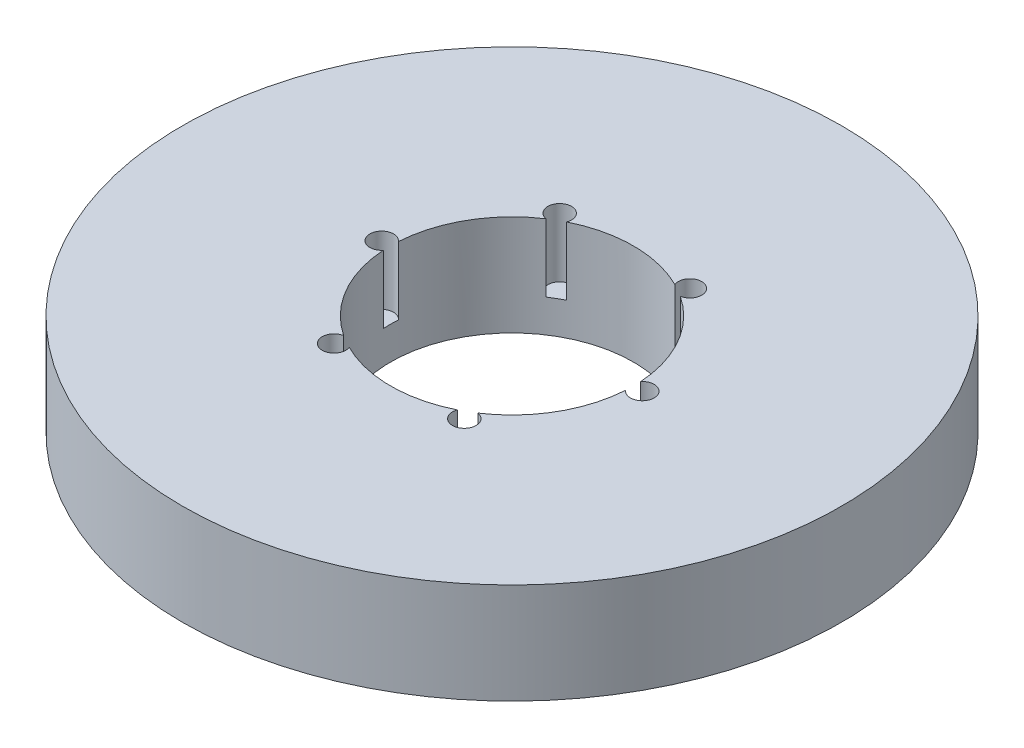
ISO-10303-21;
HEADER;
FILE_DESCRIPTION(('STEP AP214'),'2;1');
FILE_NAME('part.step','',(''),(''),'','','');
FILE_SCHEMA(('AUTOMOTIVE_DESIGN { 1 0 10303 214 1 1 1 1 }'));
ENDSEC;
DATA;
#1=APPLICATION_CONTEXT('core data for automotive mechanical design processes');
#2=APPLICATION_PROTOCOL_DEFINITION('international standard','automotive_design',2000,#1);
#3=PRODUCT_CONTEXT('',#1,'mechanical');
#4=PRODUCT('Part','Part','',(#3));
#5=PRODUCT_RELATED_PRODUCT_CATEGORY('part','',(#4));
#6=PRODUCT_DEFINITION_FORMATION('','',#4);
#7=PRODUCT_DEFINITION_CONTEXT('part definition',#1,'design');
#8=PRODUCT_DEFINITION('design','',#6,#7);
#9=PRODUCT_DEFINITION_SHAPE('','',#8);
#10=(LENGTH_UNIT() NAMED_UNIT(*) SI_UNIT(.MILLI.,.METRE.));
#11=(NAMED_UNIT(*) PLANE_ANGLE_UNIT() SI_UNIT($,.RADIAN.));
#12=(NAMED_UNIT(*) SI_UNIT($,.STERADIAN.) SOLID_ANGLE_UNIT());
#13=UNCERTAINTY_MEASURE_WITH_UNIT(LENGTH_MEASURE(1.E-05),#10,'distance_accuracy_value','');
#14=(GEOMETRIC_REPRESENTATION_CONTEXT(3) GLOBAL_UNCERTAINTY_ASSIGNED_CONTEXT((#13)) GLOBAL_UNIT_ASSIGNED_CONTEXT((#10,
#11,#12)) REPRESENTATION_CONTEXT('',''));
#15=CARTESIAN_POINT('',(0.,0.,0.));
#16=DIRECTION('',(0.,0.,1.));
#17=DIRECTION('',(1.,0.,0.));
#18=AXIS2_PLACEMENT_3D('',#15,#16,#17);
#19=CARTESIAN_POINT('',(0.,29.,0.));
#20=DIRECTION('',(0.,-1.,0.));
#21=DIRECTION('',(0.,0.,-1.));
#22=AXIS2_PLACEMENT_3D('',#19,#20,#21);
#23=CYLINDRICAL_SURFACE('',#22,95.);
#24=CARTESIAN_POINT('',(0.,29.,0.));
#25=DIRECTION('',(0.,1.,0.));
#26=DIRECTION('',(0.,0.,1.));
#27=AXIS2_PLACEMENT_3D('',#24,#25,#26);
#28=CIRCLE('',#27,95.);
#29=CARTESIAN_POINT('',(0.,29.,-95.));
#30=VERTEX_POINT('',#29);
#31=EDGE_CURVE('E171',#30,#30,#28,.T.);
#32=CARTESIAN_POINT('',(0.,0.,0.));
#33=DIRECTION('',(0.,1.,0.));
#34=DIRECTION('',(0.,0.,1.));
#35=AXIS2_PLACEMENT_3D('',#32,#33,#34);
#36=CIRCLE('',#35,95.);
#37=CARTESIAN_POINT('',(0.,0.,-95.));
#38=VERTEX_POINT('',#37);
#39=EDGE_CURVE('E157',#38,#38,#36,.T.);
#40=CARTESIAN_POINT('',(0.,29.,-95.));
#41=CARTESIAN_POINT('',(0.,28.6979166666667,-95.));
#42=CARTESIAN_POINT('',(0.,28.3958333333333,-95.));
#43=CARTESIAN_POINT('',(0.,27.7916666666667,-95.));
#44=CARTESIAN_POINT('',(0.,27.4895833333333,-95.));
#45=CARTESIAN_POINT('',(0.,26.8854166666667,-95.));
#46=CARTESIAN_POINT('',(0.,26.5833333333333,-95.));
#47=CARTESIAN_POINT('',(0.,25.9791666666667,-95.));
#48=CARTESIAN_POINT('',(0.,25.6770833333333,-95.));
#49=CARTESIAN_POINT('',(0.,25.0729166666667,-95.));
#50=CARTESIAN_POINT('',(0.,24.7708333333333,-95.));
#51=CARTESIAN_POINT('',(0.,24.1666666666667,-95.));
#52=CARTESIAN_POINT('',(0.,23.8645833333333,-95.));
#53=CARTESIAN_POINT('',(0.,23.2604166666667,-95.));
#54=CARTESIAN_POINT('',(0.,22.9583333333333,-95.));
#55=CARTESIAN_POINT('',(0.,22.3541666666667,-95.));
#56=CARTESIAN_POINT('',(0.,22.0520833333333,-95.));
#57=CARTESIAN_POINT('',(0.,21.4479166666667,-95.));
#58=CARTESIAN_POINT('',(0.,21.1458333333333,-95.));
#59=CARTESIAN_POINT('',(0.,20.5416666666667,-95.));
#60=CARTESIAN_POINT('',(0.,20.2395833333333,-95.));
#61=CARTESIAN_POINT('',(0.,19.6354166666667,-95.));
#62=CARTESIAN_POINT('',(0.,19.3333333333333,-95.));
#63=CARTESIAN_POINT('',(0.,18.7291666666667,-95.));
#64=CARTESIAN_POINT('',(0.,18.4270833333333,-95.));
#65=CARTESIAN_POINT('',(0.,17.8229166666667,-95.));
#66=CARTESIAN_POINT('',(0.,17.5208333333333,-95.));
#67=CARTESIAN_POINT('',(0.,16.9166666666667,-95.));
#68=CARTESIAN_POINT('',(0.,16.6145833333333,-95.));
#69=CARTESIAN_POINT('',(0.,16.0104166666667,-95.));
#70=CARTESIAN_POINT('',(0.,15.7083333333333,-95.));
#71=CARTESIAN_POINT('',(0.,15.1041666666667,-95.));
#72=CARTESIAN_POINT('',(0.,14.8020833333333,-95.));
#73=CARTESIAN_POINT('',(0.,14.1979166666667,-95.));
#74=CARTESIAN_POINT('',(0.,13.8958333333333,-95.));
#75=CARTESIAN_POINT('',(0.,13.2916666666667,-95.));
#76=CARTESIAN_POINT('',(0.,12.9895833333333,-95.));
#77=CARTESIAN_POINT('',(0.,12.3854166666667,-95.));
#78=CARTESIAN_POINT('',(0.,12.0833333333333,-95.));
#79=CARTESIAN_POINT('',(0.,11.4791666666667,-95.));
#80=CARTESIAN_POINT('',(0.,11.1770833333333,-95.));
#81=CARTESIAN_POINT('',(0.,10.5729166666667,-95.));
#82=CARTESIAN_POINT('',(0.,10.2708333333333,-95.));
#83=CARTESIAN_POINT('',(0.,9.66666666666667,-95.));
#84=CARTESIAN_POINT('',(0.,9.36458333333333,-95.));
#85=CARTESIAN_POINT('',(0.,8.76041666666667,-95.));
#86=CARTESIAN_POINT('',(0.,8.45833333333333,-95.));
#87=CARTESIAN_POINT('',(0.,7.85416666666667,-95.));
#88=CARTESIAN_POINT('',(0.,7.55208333333333,-95.));
#89=CARTESIAN_POINT('',(0.,6.94791666666667,-95.));
#90=CARTESIAN_POINT('',(0.,6.64583333333333,-95.));
#91=CARTESIAN_POINT('',(0.,6.04166666666667,-95.));
#92=CARTESIAN_POINT('',(0.,5.73958333333333,-95.));
#93=CARTESIAN_POINT('',(0.,5.13541666666667,-95.));
#94=CARTESIAN_POINT('',(0.,4.83333333333333,-95.));
#95=CARTESIAN_POINT('',(0.,4.22916666666667,-95.));
#96=CARTESIAN_POINT('',(0.,3.92708333333333,-95.));
#97=CARTESIAN_POINT('',(0.,3.32291666666667,-95.));
#98=CARTESIAN_POINT('',(0.,3.02083333333333,-95.));
#99=CARTESIAN_POINT('',(0.,2.41666666666667,-95.));
#100=CARTESIAN_POINT('',(0.,2.11458333333333,-95.));
#101=CARTESIAN_POINT('',(0.,1.51041666666667,-95.));
#102=CARTESIAN_POINT('',(0.,1.20833333333333,-95.));
#103=CARTESIAN_POINT('',(0.,0.604166666666667,-95.));
#104=CARTESIAN_POINT('',(0.,0.302083333333333,-95.));
#105=CARTESIAN_POINT('',(0.,0.,-95.));
#106=B_SPLINE_CURVE_WITH_KNOTS('',3,(#40,#41,#42,#43,#44,#45,#46,#47,#48,#49,#50,#51,#52,#53,
#54,#55,#56,#57,#58,#59,#60,#61,#62,#63,#64,#65,#66,#67,#68,#69,#70,#71,#72,#73,#74,#75,#76,#77,
#78,#79,#80,#81,#82,#83,#84,#85,#86,#87,#88,#89,#90,#91,#92,#93,#94,#95,#96,#97,#98,#99,#100,
#101,#102,#103,#104,#105),.UNSPECIFIED.,.F.,.F.,(4,2,2,2,2,2,2,2,2,2,2,2,2,2,2,2,2,2,2,2,2,2,2,
2,2,2,2,2,2,2,2,2,4),(0.,0.906249999999997,1.8125,2.71875,3.625,4.53125,5.4375,6.34375,7.25,
8.15625,9.0625,9.96875,10.875,11.78125,12.6875,13.59375,14.5,15.40625,16.3125,17.21875,18.125,
19.03125,19.9375,20.84375,21.75,22.65625,23.5625,24.46875,25.375,26.28125,27.1875,28.09375,29.),.UNSPECIFIED.);
#107=EDGE_CURVE('BSEAM39',#30,#38,#106,.T.);
#108=ORIENTED_EDGE('',*,*,#31,.F.);
#109=ORIENTED_EDGE('',*,*,#39,.T.);
#110=ORIENTED_EDGE('',*,*,#107,.T.);
#111=ORIENTED_EDGE('',*,*,#107,.F.);
#112=EDGE_LOOP('',(#108,#110,#109,#111));
#113=FACE_BOUND('',#112,.T.);
#114=ADVANCED_FACE('F39',(#113),#23,.T.);
#115=CARTESIAN_POINT('',(0.,29.,0.));
#116=DIRECTION('',(0.,1.,0.));
#117=DIRECTION('',(0.,0.,1.));
#118=AXIS2_PLACEMENT_3D('',#115,#116,#117);
#119=PLANE('',#118);
#120=CARTESIAN_POINT('',(-18.7786865822468,29.,-32.5256392598626));
#121=DIRECTION('',(0.,1.,0.));
#122=DIRECTION('',(-0.866025403784433,0.,0.50000000000001));
#123=AXIS2_PLACEMENT_3D('',#120,#121,#122);
#124=CIRCLE('',#123,3.40545617337743);
#125=CARTESIAN_POINT('',(-15.5872228350593,29.,-31.3374932674936));
#126=VERTEX_POINT('',#125);
#127=CARTESIAN_POINT('',(-19.3454538430443,29.,-29.1676775833566));
#128=VERTEX_POINT('',#127);
#129=EDGE_CURVE('E214',#126,#128,#124,.T.);
#130=ORIENTED_EDGE('',*,*,#129,.F.);
#131=CARTESIAN_POINT('',(0.,29.,0.));
#132=DIRECTION('',(0.,1.,0.));
#133=DIRECTION('',(0.,0.,1.));
#134=AXIS2_PLACEMENT_3D('',#131,#132,#133);
#135=CIRCLE('',#134,35.);
#136=CARTESIAN_POINT('',(15.5872228350587,29.,-31.3374932674939));
#137=VERTEX_POINT('',#136);
#138=EDGE_CURVE('E272',#137,#126,#135,.T.);
#139=ORIENTED_EDGE('',*,*,#138,.F.);
#140=CARTESIAN_POINT('',(18.7786865822461,29.,-32.5256392598629));
#141=DIRECTION('',(0.,1.,0.));
#142=DIRECTION('',(-0.866025403784443,0.,-0.499999999999992));
#143=AXIS2_PLACEMENT_3D('',#140,#141,#142);
#144=CIRCLE('',#143,3.40545617337743);
#145=CARTESIAN_POINT('',(19.3454538430437,29.,-29.167677583357));
#146=VERTEX_POINT('',#145);
#147=EDGE_CURVE('E285',#146,#137,#144,.T.);
#148=ORIENTED_EDGE('',*,*,#147,.F.);
#149=CARTESIAN_POINT('',(34.9326766781029,29.,-2.16981568413694));
#150=VERTEX_POINT('',#149);
#151=EDGE_CURVE('E165',#150,#146,#135,.T.);
#152=ORIENTED_EDGE('',*,*,#151,.F.);
#153=CARTESIAN_POINT('',(37.5573731644929,29.,0.));
#154=DIRECTION('',(0.,1.,0.));
#155=DIRECTION('',(0.,0.,-1.));
#156=AXIS2_PLACEMENT_3D('',#153,#154,#155);
#157=CIRCLE('',#156,3.40545617337743);
#158=CARTESIAN_POINT('',(34.9326766781029,29.,2.16981568413694));
#159=VERTEX_POINT('',#158);
#160=EDGE_CURVE('E281',#159,#150,#157,.T.);
#161=ORIENTED_EDGE('',*,*,#160,.F.);
#162=CARTESIAN_POINT('',(19.3454538430441,29.,29.1676775833568));
#163=VERTEX_POINT('',#162);
#164=EDGE_CURVE('E160',#163,#159,#135,.T.);
#165=ORIENTED_EDGE('',*,*,#164,.F.);
#166=CARTESIAN_POINT('',(18.7786865822466,29.,32.5256392598627));
#167=DIRECTION('',(0.,1.,0.));
#168=DIRECTION('',(0.866025403784436,0.,-0.500000000000004));
#169=AXIS2_PLACEMENT_3D('',#166,#167,#168);
#170=CIRCLE('',#169,3.40545617337743);
#171=CARTESIAN_POINT('',(15.5872228350591,29.,31.3374932674937));
#172=VERTEX_POINT('',#171);
#173=EDGE_CURVE('E154',#172,#163,#170,.T.);
#174=ORIENTED_EDGE('',*,*,#173,.F.);
#175=CARTESIAN_POINT('',(-15.5872228350589,29.,31.3374932674938));
#176=VERTEX_POINT('',#175);
#177=EDGE_CURVE('E150',#176,#172,#135,.T.);
#178=ORIENTED_EDGE('',*,*,#177,.F.);
#179=CARTESIAN_POINT('',(-18.7786865822464,29.,32.5256392598628));
#180=DIRECTION('',(0.,1.,0.));
#181=DIRECTION('',(0.86602540378444,0.,0.499999999999998));
#182=AXIS2_PLACEMENT_3D('',#179,#180,#181);
#183=CIRCLE('',#182,3.40545617337743);
#184=CARTESIAN_POINT('',(-19.3454538430439,29.,29.1676775833569));
#185=VERTEX_POINT('',#184);
#186=EDGE_CURVE('E127',#185,#176,#183,.T.);
#187=ORIENTED_EDGE('',*,*,#186,.F.);
#188=CARTESIAN_POINT('',(-34.9326766781029,29.,2.16981568413694));
#189=VERTEX_POINT('',#188);
#190=EDGE_CURVE('E156',#189,#185,#135,.T.);
#191=ORIENTED_EDGE('',*,*,#190,.F.);
#192=CARTESIAN_POINT('',(-37.5573731644929,29.,0.));
#193=DIRECTION('',(0.,1.,0.));
#194=DIRECTION('',(0.,0.,1.));
#195=AXIS2_PLACEMENT_3D('',#192,#193,#194);
#196=CIRCLE('',#195,3.40545617337743);
#197=CARTESIAN_POINT('',(-34.9326766781029,29.,-2.16981568413694));
#198=VERTEX_POINT('',#197);
#199=EDGE_CURVE('E164',#198,#189,#196,.T.);
#200=ORIENTED_EDGE('',*,*,#199,.F.);
#201=EDGE_CURVE('E159',#128,#198,#135,.T.);
#202=ORIENTED_EDGE('',*,*,#201,.F.);
#203=EDGE_LOOP('',(#130,#139,#148,#152,#161,#165,#174,#178,#187,#191,#200,#202));
#204=FACE_BOUND('',#203,.T.);
#205=ORIENTED_EDGE('',*,*,#31,.T.);
#206=EDGE_LOOP('',(#205));
#207=FACE_BOUND('',#206,.T.);
#208=ADVANCED_FACE('F155',(#204,#207),#119,.T.);
#209=CARTESIAN_POINT('',(0.,0.,0.));
#210=DIRECTION('',(0.,1.,0.));
#211=DIRECTION('',(0.,0.,1.));
#212=AXIS2_PLACEMENT_3D('',#209,#210,#211);
#213=PLANE('',#212);
#214=CARTESIAN_POINT('',(0.,0.,0.));
#215=DIRECTION('',(0.,1.,0.));
#216=DIRECTION('',(0.,0.,1.));
#217=AXIS2_PLACEMENT_3D('',#214,#215,#216);
#218=CIRCLE('',#217,35.);
#219=CARTESIAN_POINT('',(0.,0.,35.));
#220=VERTEX_POINT('',#219);
#221=EDGE_CURVE('E170',#220,#220,#218,.T.);
#222=ORIENTED_EDGE('',*,*,#221,.T.);
#223=EDGE_LOOP('',(#222));
#224=FACE_BOUND('',#223,.T.);
#225=ORIENTED_EDGE('',*,*,#39,.F.);
#226=EDGE_LOOP('',(#225));
#227=FACE_BOUND('',#226,.T.);
#228=ADVANCED_FACE('F232',(#224,#227),#213,.F.);
#229=CARTESIAN_POINT('',(0.,29.,0.));
#230=DIRECTION('',(0.,-1.,0.));
#231=DIRECTION('',(0.,0.,-1.));
#232=AXIS2_PLACEMENT_3D('',#229,#230,#231);
#233=CYLINDRICAL_SURFACE('',#232,35.);
#234=DIRECTION('',(0.,1.,0.));
#235=VECTOR('',#234,1.);
#236=CARTESIAN_POINT('',(-15.5872228350593,19.2218524024928,-31.3374932674936));
#237=LINE('',#236,#235);
#238=CARTESIAN_POINT('',(-15.5872228350593,9.44370480498569,-31.3374932674936));
#239=VERTEX_POINT('',#238);
#240=EDGE_CURVE('E11',#239,#126,#237,.T.);
#241=ORIENTED_EDGE('',*,*,#240,.F.);
#242=CARTESIAN_POINT('',(0.,9.44370480498569,0.));
#243=DIRECTION('',(0.,1.,0.));
#244=DIRECTION('',(0.,0.,1.));
#245=AXIS2_PLACEMENT_3D('',#242,#243,#244);
#246=CIRCLE('',#245,35.);
#247=CARTESIAN_POINT('',(-19.3454538430443,9.44370480498569,-29.1676775833566));
#248=VERTEX_POINT('',#247);
#249=EDGE_CURVE('E209',#239,#248,#246,.T.);
#250=ORIENTED_EDGE('',*,*,#249,.T.);
#251=DIRECTION('',(0.,1.,0.));
#252=VECTOR('',#251,1.);
#253=CARTESIAN_POINT('',(-19.3454538430443,19.2218524024928,-29.1676775833566));
#254=LINE('',#253,#252);
#255=EDGE_CURVE('E46',#128,#248,#254,.F.);
#256=ORIENTED_EDGE('',*,*,#255,.F.);
#257=ORIENTED_EDGE('',*,*,#201,.T.);
#258=DIRECTION('',(0.,1.,0.));
#259=VECTOR('',#258,1.);
#260=CARTESIAN_POINT('',(-34.9326766781028,19.2218524024928,-2.16981568413686));
#261=LINE('',#260,#259);
#262=CARTESIAN_POINT('',(-34.9326766781029,9.44370480498569,-2.16981568413694));
#263=VERTEX_POINT('',#262);
#264=EDGE_CURVE('E185',#263,#198,#261,.T.);
#265=ORIENTED_EDGE('',*,*,#264,.F.);
#266=CARTESIAN_POINT('',(0.,9.44370480498569,0.));
#267=DIRECTION('',(0.,1.,0.));
#268=DIRECTION('',(0.,0.,1.));
#269=AXIS2_PLACEMENT_3D('',#266,#267,#268);
#270=CIRCLE('',#269,35.);
#271=CARTESIAN_POINT('',(-34.9326766781029,9.44370480498569,2.16981568413694));
#272=VERTEX_POINT('',#271);
#273=EDGE_CURVE('E173',#263,#272,#270,.T.);
#274=ORIENTED_EDGE('',*,*,#273,.T.);
#275=DIRECTION('',(0.,1.,0.));
#276=VECTOR('',#275,1.);
#277=CARTESIAN_POINT('',(-34.9326766781028,19.2218524024928,2.16981568413686));
#278=LINE('',#277,#276);
#279=EDGE_CURVE('E178',#189,#272,#278,.F.);
#280=ORIENTED_EDGE('',*,*,#279,.F.);
#281=ORIENTED_EDGE('',*,*,#190,.T.);
#282=DIRECTION('',(0.,1.,0.));
#283=VECTOR('',#282,1.);
#284=CARTESIAN_POINT('',(-19.3454538430438,19.2218524024928,29.1676775833569));
#285=LINE('',#284,#283);
#286=CARTESIAN_POINT('',(-19.3454538430439,9.44370480498569,29.1676775833569));
#287=VERTEX_POINT('',#286);
#288=EDGE_CURVE('E132',#287,#185,#285,.T.);
#289=ORIENTED_EDGE('',*,*,#288,.F.);
#290=CARTESIAN_POINT('',(0.,9.44370480498569,0.));
#291=DIRECTION('',(0.,1.,0.));
#292=DIRECTION('',(0.,0.,1.));
#293=AXIS2_PLACEMENT_3D('',#290,#291,#292);
#294=CIRCLE('',#293,35.);
#295=CARTESIAN_POINT('',(-15.5872228350589,9.44370480498569,31.3374932674938));
#296=VERTEX_POINT('',#295);
#297=EDGE_CURVE('E146',#287,#296,#294,.T.);
#298=ORIENTED_EDGE('',*,*,#297,.T.);
#299=DIRECTION('',(0.,1.,0.));
#300=VECTOR('',#299,1.);
#301=CARTESIAN_POINT('',(-15.5872228350589,19.2218524024928,31.3374932674937));
#302=LINE('',#301,#300);
#303=EDGE_CURVE('E128',#176,#296,#302,.F.);
#304=ORIENTED_EDGE('',*,*,#303,.F.);
#305=ORIENTED_EDGE('',*,*,#177,.T.);
#306=DIRECTION('',(0.,1.,0.));
#307=VECTOR('',#306,1.);
#308=CARTESIAN_POINT('',(15.5872228350591,19.2218524024928,31.3374932674936));
#309=LINE('',#308,#307);
#310=CARTESIAN_POINT('',(15.5872228350591,9.44370480498569,31.3374932674937));
#311=VERTEX_POINT('',#310);
#312=EDGE_CURVE('E192',#311,#172,#309,.T.);
#313=ORIENTED_EDGE('',*,*,#312,.F.);
#314=CARTESIAN_POINT('',(0.,9.44370480498569,0.));
#315=DIRECTION('',(0.,1.,0.));
#316=DIRECTION('',(0.,0.,1.));
#317=AXIS2_PLACEMENT_3D('',#314,#315,#316);
#318=CIRCLE('',#317,35.);
#319=CARTESIAN_POINT('',(19.3454538430441,9.44370480498569,29.1676775833568));
#320=VERTEX_POINT('',#319);
#321=EDGE_CURVE('E190',#311,#320,#318,.T.);
#322=ORIENTED_EDGE('',*,*,#321,.T.);
#323=DIRECTION('',(0.,1.,0.));
#324=VECTOR('',#323,1.);
#325=CARTESIAN_POINT('',(19.345453843044,19.2218524024928,29.1676775833567));
#326=LINE('',#325,#324);
#327=EDGE_CURVE('E189',#163,#320,#326,.F.);
#328=ORIENTED_EDGE('',*,*,#327,.F.);
#329=ORIENTED_EDGE('',*,*,#164,.T.);
#330=DIRECTION('',(0.,1.,0.));
#331=VECTOR('',#330,1.);
#332=CARTESIAN_POINT('',(34.9326766781028,19.2218524024928,2.16981568413686));
#333=LINE('',#332,#331);
#334=CARTESIAN_POINT('',(34.9326766781029,9.44370480498569,2.16981568413694));
#335=VERTEX_POINT('',#334);
#336=EDGE_CURVE('E203',#335,#159,#333,.T.);
#337=ORIENTED_EDGE('',*,*,#336,.F.);
#338=CARTESIAN_POINT('',(0.,9.44370480498569,0.));
#339=DIRECTION('',(0.,1.,0.));
#340=DIRECTION('',(0.,0.,1.));
#341=AXIS2_PLACEMENT_3D('',#338,#339,#340);
#342=CIRCLE('',#341,35.);
#343=CARTESIAN_POINT('',(34.9326766781029,9.44370480498569,-2.16981568413694));
#344=VERTEX_POINT('',#343);
#345=EDGE_CURVE('E194',#335,#344,#342,.T.);
#346=ORIENTED_EDGE('',*,*,#345,.T.);
#347=DIRECTION('',(0.,1.,0.));
#348=VECTOR('',#347,1.);
#349=CARTESIAN_POINT('',(34.9326766781028,19.2218524024928,-2.16981568413686));
#350=LINE('',#349,#348);
#351=EDGE_CURVE('E196',#150,#344,#350,.F.);
#352=ORIENTED_EDGE('',*,*,#351,.F.);
#353=ORIENTED_EDGE('',*,*,#151,.T.);
#354=DIRECTION('',(0.,1.,0.));
#355=VECTOR('',#354,1.);
#356=CARTESIAN_POINT('',(19.3454538430436,19.2218524024928,-29.167677583357));
#357=LINE('',#356,#355);
#358=CARTESIAN_POINT('',(19.3454538430437,9.44370480498569,-29.167677583357));
#359=VERTEX_POINT('',#358);
#360=EDGE_CURVE('E208',#359,#146,#357,.T.);
#361=ORIENTED_EDGE('',*,*,#360,.F.);
#362=CARTESIAN_POINT('',(0.,9.44370480498569,0.));
#363=DIRECTION('',(0.,1.,0.));
#364=DIRECTION('',(0.,0.,1.));
#365=AXIS2_PLACEMENT_3D('',#362,#363,#364);
#366=CIRCLE('',#365,35.);
#367=CARTESIAN_POINT('',(15.5872228350587,9.44370480498569,-31.3374932674939));
#368=VERTEX_POINT('',#367);
#369=EDGE_CURVE('E201',#359,#368,#366,.T.);
#370=ORIENTED_EDGE('',*,*,#369,.T.);
#371=DIRECTION('',(0.,1.,0.));
#372=VECTOR('',#371,1.);
#373=CARTESIAN_POINT('',(15.5872228350587,19.2218524024928,-31.3374932674938));
#374=LINE('',#373,#372);
#375=EDGE_CURVE('E206',#137,#368,#374,.F.);
#376=ORIENTED_EDGE('',*,*,#375,.F.);
#377=ORIENTED_EDGE('',*,*,#138,.T.);
#378=EDGE_LOOP('',(#241,#250,#256,#257,#265,#274,#280,#281,#289,#298,#304,#305,#313,#322,#328,
#329,#337,#346,#352,#353,#361,#370,#376,#377));
#379=FACE_BOUND('',#378,.T.);
#380=ORIENTED_EDGE('',*,*,#221,.F.);
#381=EDGE_LOOP('',(#380));
#382=FACE_BOUND('',#381,.T.);
#383=ADVANCED_FACE('F145',(#379,#382),#233,.F.);
#384=CARTESIAN_POINT('',(-37.5573731644929,9.44370480498569,0.));
#385=DIRECTION('',(0.,1.,0.));
#386=DIRECTION('',(0.,0.,1.));
#387=AXIS2_PLACEMENT_3D('',#384,#385,#386);
#388=CYLINDRICAL_SURFACE('',#387,3.40545617337743);
#389=ORIENTED_EDGE('',*,*,#264,.T.);
#390=ORIENTED_EDGE('',*,*,#199,.T.);
#391=ORIENTED_EDGE('',*,*,#279,.T.);
#392=CARTESIAN_POINT('',(-37.5573731644929,9.44370480498569,0.));
#393=DIRECTION('',(0.,1.,0.));
#394=DIRECTION('',(0.,0.,1.));
#395=AXIS2_PLACEMENT_3D('',#392,#393,#394);
#396=CIRCLE('',#395,3.40545617337743);
#397=EDGE_CURVE('E168',#263,#272,#396,.T.);
#398=ORIENTED_EDGE('',*,*,#397,.F.);
#399=EDGE_LOOP('',(#389,#390,#391,#398));
#400=FACE_BOUND('',#399,.T.);
#401=ADVANCED_FACE('F243',(#400),#388,.F.);
#402=CARTESIAN_POINT('',(-37.5573731644929,9.44370480498569,0.));
#403=DIRECTION('',(0.,1.,0.));
#404=DIRECTION('',(0.,0.,1.));
#405=AXIS2_PLACEMENT_3D('',#402,#403,#404);
#406=PLANE('',#405);
#407=ORIENTED_EDGE('',*,*,#397,.T.);
#408=ORIENTED_EDGE('',*,*,#273,.F.);
#409=EDGE_LOOP('',(#407,#408));
#410=FACE_BOUND('',#409,.T.);
#411=ADVANCED_FACE('F247',(#410),#406,.T.);
#412=CARTESIAN_POINT('',(-18.7786865822464,9.44370480498569,32.5256392598628));
#413=DIRECTION('',(0.,1.,0.));
#414=DIRECTION('',(0.,0.,1.));
#415=AXIS2_PLACEMENT_3D('',#412,#413,#414);
#416=CYLINDRICAL_SURFACE('',#415,3.40545617337743);
#417=ORIENTED_EDGE('',*,*,#288,.T.);
#418=ORIENTED_EDGE('',*,*,#186,.T.);
#419=ORIENTED_EDGE('',*,*,#303,.T.);
#420=CARTESIAN_POINT('',(-18.7786865822464,9.44370480498569,32.5256392598628));
#421=DIRECTION('',(0.,1.,0.));
#422=DIRECTION('',(0.86602540378444,0.,0.499999999999998));
#423=AXIS2_PLACEMENT_3D('',#420,#421,#422);
#424=CIRCLE('',#423,3.40545617337743);
#425=EDGE_CURVE('E137',#287,#296,#424,.T.);
#426=ORIENTED_EDGE('',*,*,#425,.F.);
#427=EDGE_LOOP('',(#417,#418,#419,#426));
#428=FACE_BOUND('',#427,.T.);
#429=ADVANCED_FACE('F126',(#428),#416,.F.);
#430=CARTESIAN_POINT('',(-18.7786865822464,9.44370480498569,32.5256392598628));
#431=DIRECTION('',(0.,1.,0.));
#432=DIRECTION('',(0.86602540378444,0.,0.499999999999998));
#433=AXIS2_PLACEMENT_3D('',#430,#431,#432);
#434=PLANE('',#433);
#435=ORIENTED_EDGE('',*,*,#425,.T.);
#436=ORIENTED_EDGE('',*,*,#297,.F.);
#437=EDGE_LOOP('',(#435,#436));
#438=FACE_BOUND('',#437,.T.);
#439=ADVANCED_FACE('F254',(#438),#434,.T.);
#440=CARTESIAN_POINT('',(18.7786865822466,9.44370480498569,32.5256392598627));
#441=DIRECTION('',(0.,1.,0.));
#442=DIRECTION('',(0.,0.,1.));
#443=AXIS2_PLACEMENT_3D('',#440,#441,#442);
#444=CYLINDRICAL_SURFACE('',#443,3.40545617337743);
#445=ORIENTED_EDGE('',*,*,#312,.T.);
#446=ORIENTED_EDGE('',*,*,#173,.T.);
#447=ORIENTED_EDGE('',*,*,#327,.T.);
#448=CARTESIAN_POINT('',(18.7786865822466,9.44370480498569,32.5256392598627));
#449=DIRECTION('',(0.,1.,0.));
#450=DIRECTION('',(0.866025403784436,0.,-0.500000000000004));
#451=AXIS2_PLACEMENT_3D('',#448,#449,#450);
#452=CIRCLE('',#451,3.40545617337743);
#453=EDGE_CURVE('E138',#311,#320,#452,.T.);
#454=ORIENTED_EDGE('',*,*,#453,.F.);
#455=EDGE_LOOP('',(#445,#446,#447,#454));
#456=FACE_BOUND('',#455,.T.);
#457=ADVANCED_FACE('F260',(#456),#444,.F.);
#458=CARTESIAN_POINT('',(18.7786865822466,9.44370480498569,32.5256392598627));
#459=DIRECTION('',(0.,1.,0.));
#460=DIRECTION('',(0.866025403784436,0.,-0.500000000000004));
#461=AXIS2_PLACEMENT_3D('',#458,#459,#460);
#462=PLANE('',#461);
#463=ORIENTED_EDGE('',*,*,#453,.T.);
#464=ORIENTED_EDGE('',*,*,#321,.F.);
#465=EDGE_LOOP('',(#463,#464));
#466=FACE_BOUND('',#465,.T.);
#467=ADVANCED_FACE('F265',(#466),#462,.T.);
#468=CARTESIAN_POINT('',(37.5573731644929,9.44370480498569,0.));
#469=DIRECTION('',(0.,1.,0.));
#470=DIRECTION('',(0.,0.,1.));
#471=AXIS2_PLACEMENT_3D('',#468,#469,#470);
#472=CYLINDRICAL_SURFACE('',#471,3.40545617337743);
#473=ORIENTED_EDGE('',*,*,#336,.T.);
#474=ORIENTED_EDGE('',*,*,#160,.T.);
#475=ORIENTED_EDGE('',*,*,#351,.T.);
#476=CARTESIAN_POINT('',(37.5573731644929,9.44370480498569,0.));
#477=DIRECTION('',(0.,1.,0.));
#478=DIRECTION('',(0.,0.,-1.));
#479=AXIS2_PLACEMENT_3D('',#476,#477,#478);
#480=CIRCLE('',#479,3.40545617337743);
#481=EDGE_CURVE('E287',#335,#344,#480,.T.);
#482=ORIENTED_EDGE('',*,*,#481,.F.);
#483=EDGE_LOOP('',(#473,#474,#475,#482));
#484=FACE_BOUND('',#483,.T.);
#485=ADVANCED_FACE('F300',(#484),#472,.F.);
#486=CARTESIAN_POINT('',(37.5573731644929,9.44370480498569,0.));
#487=DIRECTION('',(0.,1.,0.));
#488=DIRECTION('',(0.,0.,-1.));
#489=AXIS2_PLACEMENT_3D('',#486,#487,#488);
#490=PLANE('',#489);
#491=ORIENTED_EDGE('',*,*,#481,.T.);
#492=ORIENTED_EDGE('',*,*,#345,.F.);
#493=EDGE_LOOP('',(#491,#492));
#494=FACE_BOUND('',#493,.T.);
#495=ADVANCED_FACE('F298',(#494),#490,.T.);
#496=CARTESIAN_POINT('',(18.7786865822461,9.44370480498569,-32.5256392598629));
#497=DIRECTION('',(0.,1.,0.));
#498=DIRECTION('',(0.,0.,1.));
#499=AXIS2_PLACEMENT_3D('',#496,#497,#498);
#500=CYLINDRICAL_SURFACE('',#499,3.40545617337743);
#501=ORIENTED_EDGE('',*,*,#360,.T.);
#502=ORIENTED_EDGE('',*,*,#147,.T.);
#503=ORIENTED_EDGE('',*,*,#375,.T.);
#504=CARTESIAN_POINT('',(18.7786865822461,9.44370480498569,-32.5256392598629));
#505=DIRECTION('',(0.,1.,0.));
#506=DIRECTION('',(-0.866025403784443,0.,-0.499999999999992));
#507=AXIS2_PLACEMENT_3D('',#504,#505,#506);
#508=CIRCLE('',#507,3.40545617337743);
#509=EDGE_CURVE('E56',#359,#368,#508,.T.);
#510=ORIENTED_EDGE('',*,*,#509,.F.);
#511=EDGE_LOOP('',(#501,#502,#503,#510));
#512=FACE_BOUND('',#511,.T.);
#513=ADVANCED_FACE('F301',(#512),#500,.F.);
#514=CARTESIAN_POINT('',(18.7786865822461,9.44370480498569,-32.5256392598629));
#515=DIRECTION('',(0.,1.,0.));
#516=DIRECTION('',(-0.866025403784443,0.,-0.499999999999992));
#517=AXIS2_PLACEMENT_3D('',#514,#515,#516);
#518=PLANE('',#517);
#519=ORIENTED_EDGE('',*,*,#509,.T.);
#520=ORIENTED_EDGE('',*,*,#369,.F.);
#521=EDGE_LOOP('',(#519,#520));
#522=FACE_BOUND('',#521,.T.);
#523=ADVANCED_FACE('F221',(#522),#518,.T.);
#524=CARTESIAN_POINT('',(-18.7786865822468,9.44370480498569,-32.5256392598626));
#525=DIRECTION('',(0.,1.,0.));
#526=DIRECTION('',(0.,0.,1.));
#527=AXIS2_PLACEMENT_3D('',#524,#525,#526);
#528=CYLINDRICAL_SURFACE('',#527,3.40545617337743);
#529=ORIENTED_EDGE('',*,*,#240,.T.);
#530=ORIENTED_EDGE('',*,*,#129,.T.);
#531=ORIENTED_EDGE('',*,*,#255,.T.);
#532=CARTESIAN_POINT('',(-18.7786865822468,9.44370480498569,-32.5256392598626));
#533=DIRECTION('',(0.,1.,0.));
#534=DIRECTION('',(-0.866025403784433,0.,0.50000000000001));
#535=AXIS2_PLACEMENT_3D('',#532,#533,#534);
#536=CIRCLE('',#535,3.40545617337743);
#537=EDGE_CURVE('E55',#239,#248,#536,.T.);
#538=ORIENTED_EDGE('',*,*,#537,.F.);
#539=EDGE_LOOP('',(#529,#530,#531,#538));
#540=FACE_BOUND('',#539,.T.);
#541=ADVANCED_FACE('F212',(#540),#528,.F.);
#542=CARTESIAN_POINT('',(-18.7786865822468,9.44370480498569,-32.5256392598626));
#543=DIRECTION('',(0.,1.,0.));
#544=DIRECTION('',(-0.866025403784433,0.,0.50000000000001));
#545=AXIS2_PLACEMENT_3D('',#542,#543,#544);
#546=PLANE('',#545);
#547=ORIENTED_EDGE('',*,*,#537,.T.);
#548=ORIENTED_EDGE('',*,*,#249,.F.);
#549=EDGE_LOOP('',(#547,#548));
#550=FACE_BOUND('',#549,.T.);
#551=ADVANCED_FACE('F217',(#550),#546,.T.);
#552=CLOSED_SHELL('',(#114,#208,#228,#383,#401,#411,#429,#439,#457,#467,#485,#495,#513,#523,
#541,#551));
#553=MANIFOLD_SOLID_BREP('B2',#552);
#554=ADVANCED_BREP_SHAPE_REPRESENTATION('',(#18,#553),#14);
#555=SHAPE_DEFINITION_REPRESENTATION(#9,#554);
ENDSEC;
END-ISO-10303-21;
